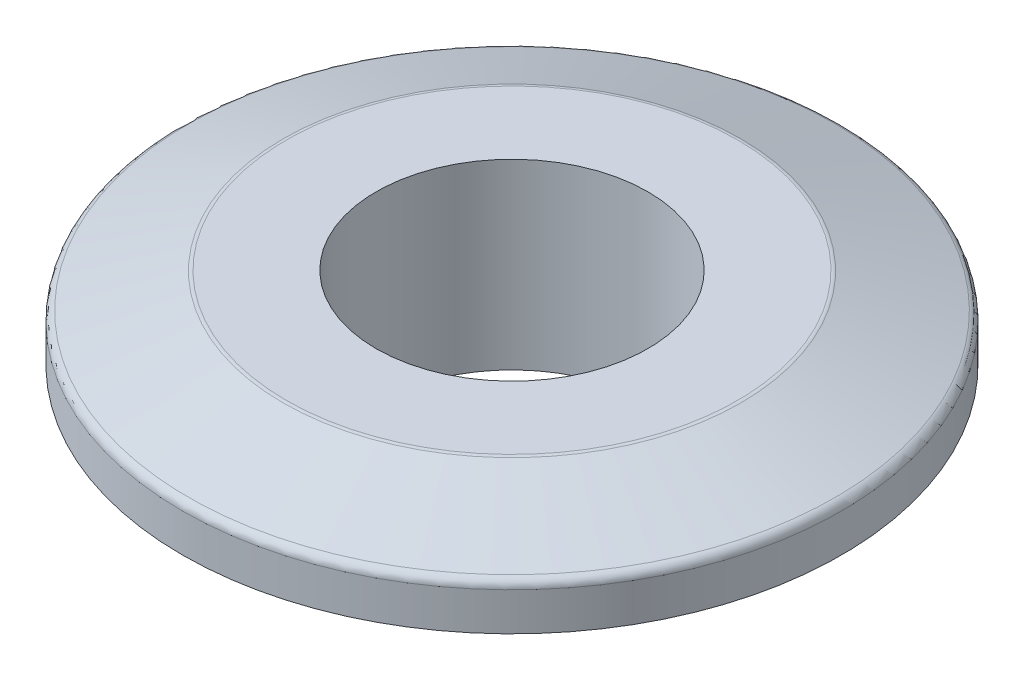
ISO-10303-21;
HEADER;
FILE_DESCRIPTION(('STEP AP214'),'2;1');
FILE_NAME('part.step','',(''),(''),'','','');
FILE_SCHEMA(('AUTOMOTIVE_DESIGN { 1 0 10303 214 1 1 1 1 }'));
ENDSEC;
DATA;
#1=APPLICATION_CONTEXT('core data for automotive mechanical design processes');
#2=APPLICATION_PROTOCOL_DEFINITION('international standard','automotive_design',2000,#1);
#3=PRODUCT_CONTEXT('',#1,'mechanical');
#4=PRODUCT('Part','Part','',(#3));
#5=PRODUCT_RELATED_PRODUCT_CATEGORY('part','',(#4));
#6=PRODUCT_DEFINITION_FORMATION('','',#4);
#7=PRODUCT_DEFINITION_CONTEXT('part definition',#1,'design');
#8=PRODUCT_DEFINITION('design','',#6,#7);
#9=PRODUCT_DEFINITION_SHAPE('','',#8);
#10=(LENGTH_UNIT() NAMED_UNIT(*) SI_UNIT(.MILLI.,.METRE.));
#11=(NAMED_UNIT(*) PLANE_ANGLE_UNIT() SI_UNIT($,.RADIAN.));
#12=(NAMED_UNIT(*) SI_UNIT($,.STERADIAN.) SOLID_ANGLE_UNIT());
#13=UNCERTAINTY_MEASURE_WITH_UNIT(LENGTH_MEASURE(1.E-05),#10,'distance_accuracy_value','');
#14=(GEOMETRIC_REPRESENTATION_CONTEXT(3) GLOBAL_UNCERTAINTY_ASSIGNED_CONTEXT((#13)) GLOBAL_UNIT_ASSIGNED_CONTEXT((#10,
#11,#12)) REPRESENTATION_CONTEXT('',''));
#15=CARTESIAN_POINT('',(0.,0.,0.));
#16=DIRECTION('',(0.,0.,1.));
#17=DIRECTION('',(1.,0.,0.));
#18=AXIS2_PLACEMENT_3D('',#15,#16,#17);
#19=CARTESIAN_POINT('',(0.,0.,0.));
#20=DIRECTION('',(0.,1.,0.));
#21=DIRECTION('',(0.,0.,1.));
#22=AXIS2_PLACEMENT_3D('',#19,#20,#21);
#23=PLANE('',#22);
#24=CARTESIAN_POINT('',(0.,0.,0.));
#25=DIRECTION('',(0.,1.,0.));
#26=DIRECTION('',(0.,0.,1.));
#27=AXIS2_PLACEMENT_3D('',#24,#25,#26);
#28=CIRCLE('',#27,12.065);
#29=CARTESIAN_POINT('',(0.,0.,12.065));
#30=VERTEX_POINT('',#29);
#31=EDGE_CURVE('E53',#30,#30,#28,.F.);
#32=ORIENTED_EDGE('',*,*,#31,.T.);
#33=EDGE_LOOP('',(#32));
#34=FACE_BOUND('',#33,.T.);
#35=CARTESIAN_POINT('',(0.,0.,0.));
#36=DIRECTION('',(0.,1.,0.));
#37=DIRECTION('',(0.,0.,1.));
#38=AXIS2_PLACEMENT_3D('',#35,#36,#37);
#39=CIRCLE('',#38,9.271);
#40=CARTESIAN_POINT('',(0.,0.,9.271));
#41=VERTEX_POINT('',#40);
#42=EDGE_CURVE('E57',#41,#41,#39,.T.);
#43=ORIENTED_EDGE('',*,*,#42,.T.);
#44=EDGE_LOOP('',(#43));
#45=FACE_BOUND('',#44,.T.);
#46=ADVANCED_FACE('F30',(#34,#45),#23,.F.);
#47=CARTESIAN_POINT('',(0.,12.446,0.));
#48=DIRECTION('',(0.,-1.,0.));
#49=DIRECTION('',(0.,0.,-1.));
#50=AXIS2_PLACEMENT_3D('',#47,#48,#49);
#51=CYLINDRICAL_SURFACE('',#50,22.479);
#52=CARTESIAN_POINT('',(0.,9.46136821323683,0.));
#53=DIRECTION('',(0.,1.,0.));
#54=DIRECTION('',(0.,0.,1.));
#55=AXIS2_PLACEMENT_3D('',#52,#53,#54);
#56=CIRCLE('',#55,22.479);
#57=CARTESIAN_POINT('',(0.,9.46136821323683,22.479));
#58=VERTEX_POINT('',#57);
#59=EDGE_CURVE('E10',#58,#58,#56,.F.);
#60=ORIENTED_EDGE('',*,*,#59,.T.);
#61=EDGE_LOOP('',(#60));
#62=FACE_BOUND('',#61,.T.);
#63=CARTESIAN_POINT('',(0.,6.858,0.));
#64=DIRECTION('',(0.,-1.,0.));
#65=DIRECTION('',(0.,0.,-1.));
#66=AXIS2_PLACEMENT_3D('',#63,#64,#65);
#67=CIRCLE('',#66,22.479);
#68=CARTESIAN_POINT('',(0.,6.858,-22.479));
#69=VERTEX_POINT('',#68);
#70=EDGE_CURVE('E60',#69,#69,#67,.T.);
#71=ORIENTED_EDGE('',*,*,#70,.F.);
#72=EDGE_LOOP('',(#71));
#73=FACE_BOUND('',#72,.T.);
#74=ADVANCED_FACE('F78',(#62,#73),#51,.T.);
#75=CARTESIAN_POINT('',(0.,12.446,0.));
#76=DIRECTION('',(0.,1.,0.));
#77=DIRECTION('',(0.,0.,1.));
#78=AXIS2_PLACEMENT_3D('',#75,#76,#77);
#79=PLANE('',#78);
#80=CARTESIAN_POINT('',(0.,12.446,0.));
#81=DIRECTION('',(0.,1.,0.));
#82=DIRECTION('',(0.,0.,1.));
#83=AXIS2_PLACEMENT_3D('',#80,#81,#82);
#84=CIRCLE('',#83,15.3884397218354);
#85=CARTESIAN_POINT('',(0.,12.446,15.3884397218354));
#86=VERTEX_POINT('',#85);
#87=EDGE_CURVE('E45',#86,#86,#84,.T.);
#88=ORIENTED_EDGE('',*,*,#87,.T.);
#89=EDGE_LOOP('',(#88));
#90=FACE_BOUND('',#89,.T.);
#91=CARTESIAN_POINT('',(0.,12.446,0.));
#92=DIRECTION('',(0.,1.,0.));
#93=DIRECTION('',(0.,0.,1.));
#94=AXIS2_PLACEMENT_3D('',#91,#92,#93);
#95=CIRCLE('',#94,9.271);
#96=CARTESIAN_POINT('',(0.,12.446,9.271));
#97=VERTEX_POINT('',#96);
#98=EDGE_CURVE('E56',#97,#97,#95,.T.);
#99=ORIENTED_EDGE('',*,*,#98,.F.);
#100=EDGE_LOOP('',(#99));
#101=FACE_BOUND('',#100,.T.);
#102=ADVANCED_FACE('F80',(#90,#101),#79,.T.);
#103=CARTESIAN_POINT('',(0.,12.446,0.));
#104=DIRECTION('',(0.,-1.,0.));
#105=DIRECTION('',(0.,0.,-1.));
#106=AXIS2_PLACEMENT_3D('',#103,#104,#105);
#107=CYLINDRICAL_SURFACE('',#106,9.271);
#108=ORIENTED_EDGE('',*,*,#98,.T.);
#109=EDGE_LOOP('',(#108));
#110=FACE_BOUND('',#109,.T.);
#111=ORIENTED_EDGE('',*,*,#42,.F.);
#112=EDGE_LOOP('',(#111));
#113=FACE_BOUND('',#112,.T.);
#114=ADVANCED_FACE('F74',(#110,#113),#107,.F.);
#115=CARTESIAN_POINT('',(0.,6.858,0.));
#116=DIRECTION('',(0.,-1.,0.));
#117=DIRECTION('',(0.,0.,-1.));
#118=AXIS2_PLACEMENT_3D('',#115,#116,#117);
#119=PLANE('',#118);
#120=CARTESIAN_POINT('',(0.,6.858,0.));
#121=DIRECTION('',(0.,-1.,0.));
#122=DIRECTION('',(0.,0.,-1.));
#123=AXIS2_PLACEMENT_3D('',#120,#121,#122);
#124=CIRCLE('',#123,12.7);
#125=CARTESIAN_POINT('',(0.,6.858,-12.7));
#126=VERTEX_POINT('',#125);
#127=EDGE_CURVE('E65',#126,#126,#124,.T.);
#128=ORIENTED_EDGE('',*,*,#127,.F.);
#129=EDGE_LOOP('',(#128));
#130=FACE_BOUND('',#129,.T.);
#131=ORIENTED_EDGE('',*,*,#70,.T.);
#132=EDGE_LOOP('',(#131));
#133=FACE_BOUND('',#132,.T.);
#134=ADVANCED_FACE('F71',(#130,#133),#119,.T.);
#135=CARTESIAN_POINT('',(0.,6.858,0.));
#136=DIRECTION('',(0.,-1.,0.));
#137=DIRECTION('',(0.,0.,-1.));
#138=AXIS2_PLACEMENT_3D('',#135,#136,#137);
#139=CYLINDRICAL_SURFACE('',#138,12.7);
#140=CARTESIAN_POINT('',(0.,0.634999999999988,0.));
#141=DIRECTION('',(0.,1.,0.));
#142=DIRECTION('',(0.,0.,1.));
#143=AXIS2_PLACEMENT_3D('',#140,#141,#142);
#144=CIRCLE('',#143,12.7);
#145=CARTESIAN_POINT('',(0.,0.634999999999988,12.7));
#146=VERTEX_POINT('',#145);
#147=EDGE_CURVE('E50',#146,#146,#144,.T.);
#148=ORIENTED_EDGE('',*,*,#147,.T.);
#149=EDGE_LOOP('',(#148));
#150=FACE_BOUND('',#149,.T.);
#151=ORIENTED_EDGE('',*,*,#127,.T.);
#152=EDGE_LOOP('',(#151));
#153=FACE_BOUND('',#152,.T.);
#154=ADVANCED_FACE('F69',(#150,#153),#139,.T.);
#155=CARTESIAN_POINT('',(0.,12.446,0.));
#156=DIRECTION('',(0.,-1.,0.));
#157=DIRECTION('',(0.,0.,-1.));
#158=AXIS2_PLACEMENT_3D('',#155,#156,#157);
#159=CONICAL_SURFACE('',#158,15.5004073545853,1.22173047639603);
#160=CARTESIAN_POINT('',(0.,12.4077048141991,0.));
#161=DIRECTION('',(0.,1.,0.));
#162=DIRECTION('',(0.,0.,1.));
#163=AXIS2_PLACEMENT_3D('',#160,#161,#162);
#164=CIRCLE('',#163,15.6056225128472);
#165=CARTESIAN_POINT('',(0.,12.4077048141991,15.6056225128472));
#166=VERTEX_POINT('',#165);
#167=EDGE_CURVE('E37',#166,#166,#164,.F.);
#168=ORIENTED_EDGE('',*,*,#167,.T.);
#169=EDGE_LOOP('',(#168));
#170=FACE_BOUND('',#169,.T.);
#171=CARTESIAN_POINT('',(0.,10.0580730274359,0.));
#172=DIRECTION('',(0.,-1.,0.));
#173=DIRECTION('',(0.,0.,-1.));
#174=AXIS2_PLACEMENT_3D('',#171,#172,#173);
#175=CIRCLE('',#174,22.0611827910118);
#176=CARTESIAN_POINT('',(0.,10.0580730274359,-22.0611827910118));
#177=VERTEX_POINT('',#176);
#178=EDGE_CURVE('E41',#177,#177,#175,.F.);
#179=ORIENTED_EDGE('',*,*,#178,.T.);
#180=EDGE_LOOP('',(#179));
#181=FACE_BOUND('',#180,.T.);
#182=ADVANCED_FACE('F91',(#170,#181),#159,.T.);
#183=CARTESIAN_POINT('',(0.,0.,0.));
#184=DIRECTION('',(0.,1.,0.));
#185=DIRECTION('',(0.,0.,1.));
#186=AXIS2_PLACEMENT_3D('',#183,#184,#185);
#187=CONICAL_SURFACE('',#186,12.065,0.785398163397452);
#188=ORIENTED_EDGE('',*,*,#147,.F.);
#189=EDGE_LOOP('',(#188));
#190=FACE_BOUND('',#189,.T.);
#191=ORIENTED_EDGE('',*,*,#31,.F.);
#192=EDGE_LOOP('',(#191));
#193=FACE_BOUND('',#192,.T.);
#194=ADVANCED_FACE('F94',(#190,#193),#187,.T.);
#195=CARTESIAN_POINT('',(0.,11.811,0.));
#196=DIRECTION('',(0.,1.,0.));
#197=DIRECTION('',(0.,0.,1.));
#198=AXIS2_PLACEMENT_3D('',#195,#196,#197);
#199=TOROIDAL_SURFACE('',#198,15.3884397218354,0.635);
#200=ORIENTED_EDGE('',*,*,#167,.F.);
#201=EDGE_LOOP('',(#200));
#202=FACE_BOUND('',#201,.T.);
#203=ORIENTED_EDGE('',*,*,#87,.F.);
#204=EDGE_LOOP('',(#203));
#205=FACE_BOUND('',#204,.T.);
#206=ADVANCED_FACE('F96',(#202,#205),#199,.T.);
#207=CARTESIAN_POINT('',(0.,9.46136821323683,0.));
#208=DIRECTION('',(0.,1.,0.));
#209=DIRECTION('',(0.,0.,1.));
#210=AXIS2_PLACEMENT_3D('',#207,#208,#209);
#211=TOROIDAL_SURFACE('',#210,21.844,0.635);
#212=ORIENTED_EDGE('',*,*,#178,.F.);
#213=EDGE_LOOP('',(#212));
#214=FACE_BOUND('',#213,.T.);
#215=ORIENTED_EDGE('',*,*,#59,.F.);
#216=EDGE_LOOP('',(#215));
#217=FACE_BOUND('',#216,.T.);
#218=ADVANCED_FACE('F32',(#214,#217),#211,.T.);
#219=CLOSED_SHELL('',(#46,#74,#102,#114,#134,#154,#182,#194,#206,#218));
#220=MANIFOLD_SOLID_BREP('B2',#219);
#221=ADVANCED_BREP_SHAPE_REPRESENTATION('',(#18,#220),#14);
#222=SHAPE_DEFINITION_REPRESENTATION(#9,#221);
ENDSEC;
END-ISO-10303-21;
